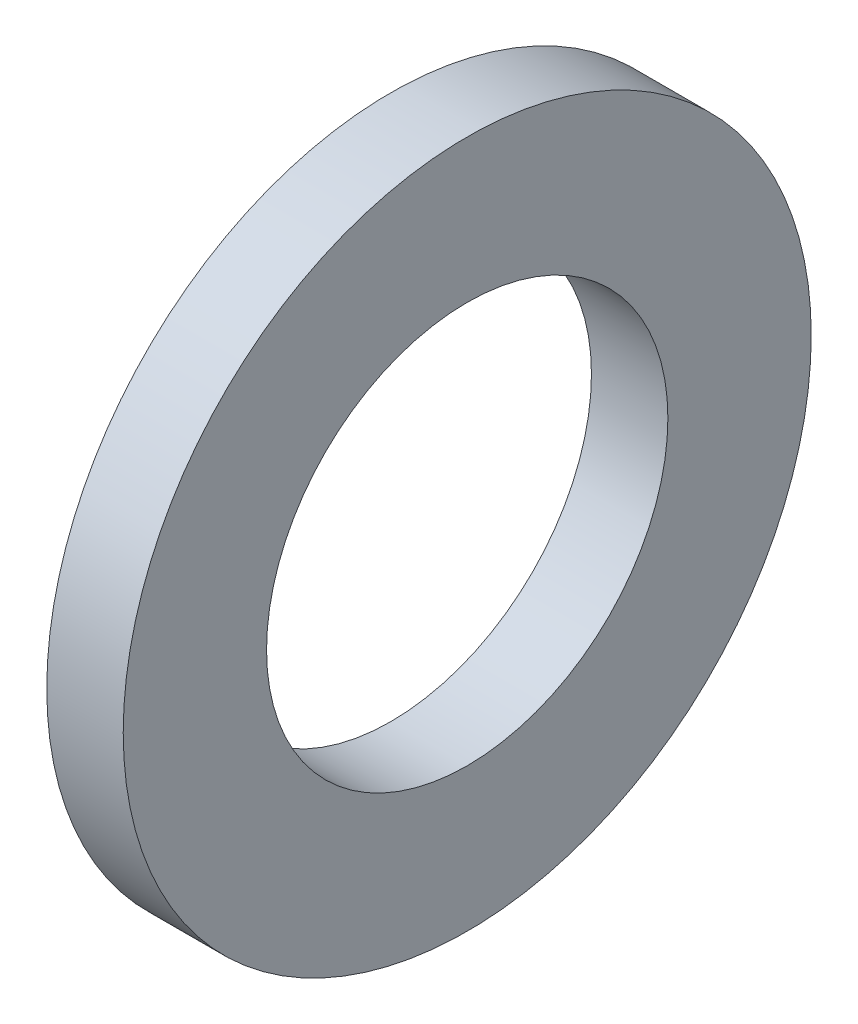
ISO-10303-21;
HEADER;
FILE_DESCRIPTION(('STEP AP214'),'2;1');
FILE_NAME('part.step','',(''),(''),'','','');
FILE_SCHEMA(('AUTOMOTIVE_DESIGN { 1 0 10303 214 1 1 1 1 }'));
ENDSEC;
DATA;
#1=APPLICATION_CONTEXT('core data for automotive mechanical design processes');
#2=APPLICATION_PROTOCOL_DEFINITION('international standard','automotive_design',2000,#1);
#3=PRODUCT_CONTEXT('',#1,'mechanical');
#4=PRODUCT('Part','Part','',(#3));
#5=PRODUCT_RELATED_PRODUCT_CATEGORY('part','',(#4));
#6=PRODUCT_DEFINITION_FORMATION('','',#4);
#7=PRODUCT_DEFINITION_CONTEXT('part definition',#1,'design');
#8=PRODUCT_DEFINITION('design','',#6,#7);
#9=PRODUCT_DEFINITION_SHAPE('','',#8);
#10=(LENGTH_UNIT() NAMED_UNIT(*) SI_UNIT(.MILLI.,.METRE.));
#11=(NAMED_UNIT(*) PLANE_ANGLE_UNIT() SI_UNIT($,.RADIAN.));
#12=(NAMED_UNIT(*) SI_UNIT($,.STERADIAN.) SOLID_ANGLE_UNIT());
#13=UNCERTAINTY_MEASURE_WITH_UNIT(LENGTH_MEASURE(1.E-05),#10,'distance_accuracy_value','');
#14=(GEOMETRIC_REPRESENTATION_CONTEXT(3) GLOBAL_UNCERTAINTY_ASSIGNED_CONTEXT((#13)) GLOBAL_UNIT_ASSIGNED_CONTEXT((#10,
#11,#12)) REPRESENTATION_CONTEXT('',''));
#15=CARTESIAN_POINT('',(0.,0.,0.));
#16=DIRECTION('',(0.,0.,1.));
#17=DIRECTION('',(1.,0.,0.));
#18=AXIS2_PLACEMENT_3D('',#15,#16,#17);
#19=CARTESIAN_POINT('',(-34.9249999999999,0.,0.));
#20=DIRECTION('',(-1.,0.,0.));
#21=DIRECTION('',(0.,0.,1.));
#22=AXIS2_PLACEMENT_3D('',#19,#20,#21);
#23=CYLINDRICAL_SURFACE('',#22,5.25);
#24=CARTESIAN_POINT('',(0.,0.,0.));
#25=DIRECTION('',(-1.,0.,0.));
#26=DIRECTION('',(0.,0.,1.));
#27=AXIS2_PLACEMENT_3D('',#24,#25,#26);
#28=CIRCLE('',#27,5.25);
#29=CARTESIAN_POINT('',(0.,0.,5.25));
#30=VERTEX_POINT('',#29);
#31=EDGE_CURVE('E10',#30,#30,#28,.T.);
#32=ORIENTED_EDGE('',*,*,#31,.F.);
#33=EDGE_LOOP('',(#32));
#34=FACE_BOUND('',#33,.T.);
#35=CARTESIAN_POINT('',(-2.,0.,0.));
#36=DIRECTION('',(-1.,0.,0.));
#37=DIRECTION('',(0.,0.,1.));
#38=AXIS2_PLACEMENT_3D('',#35,#36,#37);
#39=CIRCLE('',#38,5.25);
#40=CARTESIAN_POINT('',(-2.,0.,5.25));
#41=VERTEX_POINT('',#40);
#42=EDGE_CURVE('E46',#41,#41,#39,.T.);
#43=ORIENTED_EDGE('',*,*,#42,.T.);
#44=EDGE_LOOP('',(#43));
#45=FACE_BOUND('',#44,.T.);
#46=ADVANCED_FACE('F32',(#34,#45),#23,.F.);
#47=CARTESIAN_POINT('',(0.,5.25,0.));
#48=DIRECTION('',(-1.,0.,0.));
#49=DIRECTION('',(0.,0.,1.));
#50=AXIS2_PLACEMENT_3D('',#47,#48,#49);
#51=PLANE('',#50);
#52=CARTESIAN_POINT('',(0.,0.,0.));
#53=DIRECTION('',(-1.,0.,0.));
#54=DIRECTION('',(0.,0.,1.));
#55=AXIS2_PLACEMENT_3D('',#52,#53,#54);
#56=CIRCLE('',#55,9.);
#57=CARTESIAN_POINT('',(0.,0.,9.));
#58=VERTEX_POINT('',#57);
#59=EDGE_CURVE('E38',#58,#58,#56,.T.);
#60=ORIENTED_EDGE('',*,*,#59,.F.);
#61=EDGE_LOOP('',(#60));
#62=FACE_BOUND('',#61,.T.);
#63=ORIENTED_EDGE('',*,*,#31,.T.);
#64=EDGE_LOOP('',(#63));
#65=FACE_BOUND('',#64,.T.);
#66=ADVANCED_FACE('F61',(#62,#65),#51,.F.);
#67=CARTESIAN_POINT('',(-34.9249999999999,0.,0.));
#68=DIRECTION('',(-1.,0.,0.));
#69=DIRECTION('',(0.,0.,1.));
#70=AXIS2_PLACEMENT_3D('',#67,#68,#69);
#71=CYLINDRICAL_SURFACE('',#70,9.);
#72=CARTESIAN_POINT('',(-2.,0.,0.));
#73=DIRECTION('',(-1.,0.,0.));
#74=DIRECTION('',(0.,0.,1.));
#75=AXIS2_PLACEMENT_3D('',#72,#73,#74);
#76=CIRCLE('',#75,9.);
#77=CARTESIAN_POINT('',(-2.,0.,9.));
#78=VERTEX_POINT('',#77);
#79=EDGE_CURVE('E42',#78,#78,#76,.T.);
#80=ORIENTED_EDGE('',*,*,#79,.F.);
#81=EDGE_LOOP('',(#80));
#82=FACE_BOUND('',#81,.T.);
#83=ORIENTED_EDGE('',*,*,#59,.T.);
#84=EDGE_LOOP('',(#83));
#85=FACE_BOUND('',#84,.T.);
#86=ADVANCED_FACE('F56',(#82,#85),#71,.T.);
#87=CARTESIAN_POINT('',(-2.,9.,0.));
#88=DIRECTION('',(1.,0.,0.));
#89=DIRECTION('',(0.,0.,-1.));
#90=AXIS2_PLACEMENT_3D('',#87,#88,#89);
#91=PLANE('',#90);
#92=ORIENTED_EDGE('',*,*,#42,.F.);
#93=EDGE_LOOP('',(#92));
#94=FACE_BOUND('',#93,.T.);
#95=ORIENTED_EDGE('',*,*,#79,.T.);
#96=EDGE_LOOP('',(#95));
#97=FACE_BOUND('',#96,.T.);
#98=ADVANCED_FACE('F53',(#94,#97),#91,.F.);
#99=CLOSED_SHELL('',(#46,#66,#86,#98));
#100=MANIFOLD_SOLID_BREP('B2',#99);
#101=ADVANCED_BREP_SHAPE_REPRESENTATION('',(#18,#100),#14);
#102=SHAPE_DEFINITION_REPRESENTATION(#9,#101);
ENDSEC;
END-ISO-10303-21;
